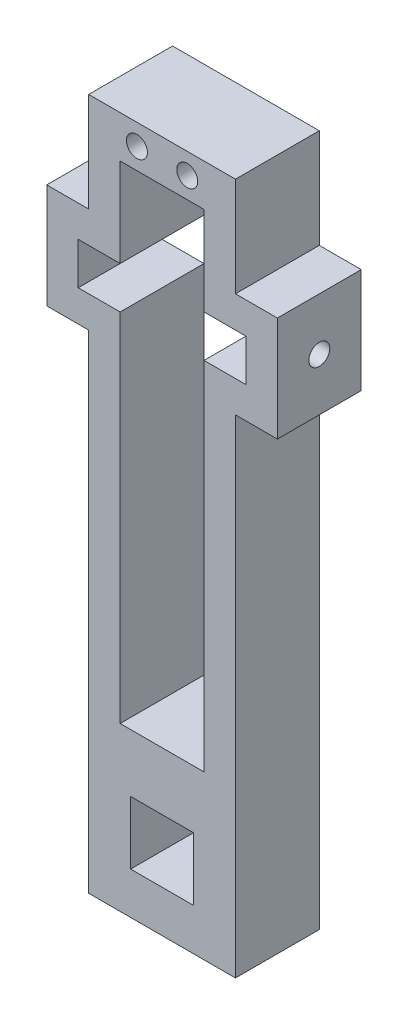
ISO-10303-21;
HEADER;
FILE_DESCRIPTION(('STEP AP214'),'2;1');
FILE_NAME('part.step','',(''),(''),'','','');
FILE_SCHEMA(('AUTOMOTIVE_DESIGN { 1 0 10303 214 1 1 1 1 }'));
ENDSEC;
DATA;
#1=APPLICATION_CONTEXT('core data for automotive mechanical design processes');
#2=APPLICATION_PROTOCOL_DEFINITION('international standard','automotive_design',2000,#1);
#3=PRODUCT_CONTEXT('',#1,'mechanical');
#4=PRODUCT('Part','Part','',(#3));
#5=PRODUCT_RELATED_PRODUCT_CATEGORY('part','',(#4));
#6=PRODUCT_DEFINITION_FORMATION('','',#4);
#7=PRODUCT_DEFINITION_CONTEXT('part definition',#1,'design');
#8=PRODUCT_DEFINITION('design','',#6,#7);
#9=PRODUCT_DEFINITION_SHAPE('','',#8);
#10=(LENGTH_UNIT() NAMED_UNIT(*) SI_UNIT(.MILLI.,.METRE.));
#11=(NAMED_UNIT(*) PLANE_ANGLE_UNIT() SI_UNIT($,.RADIAN.));
#12=(NAMED_UNIT(*) SI_UNIT($,.STERADIAN.) SOLID_ANGLE_UNIT());
#13=UNCERTAINTY_MEASURE_WITH_UNIT(LENGTH_MEASURE(1.E-05),#10,'distance_accuracy_value','');
#14=(GEOMETRIC_REPRESENTATION_CONTEXT(3) GLOBAL_UNCERTAINTY_ASSIGNED_CONTEXT((#13)) GLOBAL_UNIT_ASSIGNED_CONTEXT((#10,
#11,#12)) REPRESENTATION_CONTEXT('',''));
#15=CARTESIAN_POINT('',(0.,0.,0.));
#16=DIRECTION('',(0.,0.,1.));
#17=DIRECTION('',(1.,0.,0.));
#18=AXIS2_PLACEMENT_3D('',#15,#16,#17);
#19=CARTESIAN_POINT('',(0.,0.,4.));
#20=DIRECTION('',(0.,0.,1.));
#21=DIRECTION('',(1.,0.,0.));
#22=AXIS2_PLACEMENT_3D('',#19,#20,#21);
#23=PLANE('',#22);
#24=CARTESIAN_POINT('',(-1.2,28.5,4.));
#25=DIRECTION('',(0.,0.,1.));
#26=DIRECTION('',(1.,0.,0.));
#27=AXIS2_PLACEMENT_3D('',#24,#25,#26);
#28=CIRCLE('',#27,0.5);
#29=CARTESIAN_POINT('',(-0.7,28.5,4.));
#30=VERTEX_POINT('',#29);
#31=EDGE_CURVE('E266',#30,#30,#28,.T.);
#32=ORIENTED_EDGE('',*,*,#31,.F.);
#33=EDGE_LOOP('',(#32));
#34=FACE_BOUND('',#33,.T.);
#35=DIRECTION('',(0.,-1.,0.));
#36=VECTOR('',#35,1.);
#37=CARTESIAN_POINT('',(-3.5,3.5,4.));
#38=LINE('',#37,#36);
#39=CARTESIAN_POINT('',(-3.5,19.7632289487629,4.));
#40=VERTEX_POINT('',#39);
#41=CARTESIAN_POINT('',(-3.5,-3.5,4.));
#42=VERTEX_POINT('',#41);
#43=EDGE_CURVE('E359',#40,#42,#38,.T.);
#44=ORIENTED_EDGE('',*,*,#43,.T.);
#45=DIRECTION('',(1.,0.,0.));
#46=VECTOR('',#45,1.);
#47=CARTESIAN_POINT('',(3.5,-3.5,4.));
#48=LINE('',#47,#46);
#49=CARTESIAN_POINT('',(3.5,-3.5,4.));
#50=VERTEX_POINT('',#49);
#51=EDGE_CURVE('E361',#42,#50,#48,.T.);
#52=ORIENTED_EDGE('',*,*,#51,.T.);
#53=DIRECTION('',(0.,1.,0.));
#54=VECTOR('',#53,1.);
#55=CARTESIAN_POINT('',(3.5,-3.5,4.));
#56=LINE('',#55,#54);
#57=CARTESIAN_POINT('',(3.5,19.7632289487629,4.));
#58=VERTEX_POINT('',#57);
#59=EDGE_CURVE('E364',#50,#58,#56,.T.);
#60=ORIENTED_EDGE('',*,*,#59,.T.);
#61=DIRECTION('',(1.,0.,0.));
#62=VECTOR('',#61,1.);
#63=CARTESIAN_POINT('',(3.5,19.7632289487629,4.));
#64=LINE('',#63,#62);
#65=CARTESIAN_POINT('',(5.5,19.7632289487629,4.));
#66=VERTEX_POINT('',#65);
#67=EDGE_CURVE('E366',#58,#66,#64,.T.);
#68=ORIENTED_EDGE('',*,*,#67,.T.);
#69=DIRECTION('',(0.,1.,0.));
#70=VECTOR('',#69,1.);
#71=CARTESIAN_POINT('',(5.5,19.7632289487629,4.));
#72=LINE('',#71,#70);
#73=CARTESIAN_POINT('',(5.5,24.7632289487629,4.));
#74=VERTEX_POINT('',#73);
#75=EDGE_CURVE('E368',#66,#74,#72,.T.);
#76=ORIENTED_EDGE('',*,*,#75,.T.);
#77=DIRECTION('',(-1.,0.,0.));
#78=VECTOR('',#77,1.);
#79=CARTESIAN_POINT('',(3.5,24.7632289487629,4.));
#80=LINE('',#79,#78);
#81=CARTESIAN_POINT('',(3.5,24.7632289487629,4.));
#82=VERTEX_POINT('',#81);
#83=EDGE_CURVE('E370',#74,#82,#80,.T.);
#84=ORIENTED_EDGE('',*,*,#83,.T.);
#85=DIRECTION('',(0.,1.,0.));
#86=VECTOR('',#85,1.);
#87=CARTESIAN_POINT('',(3.5,24.7632289487629,4.));
#88=LINE('',#87,#86);
#89=CARTESIAN_POINT('',(3.49999999999999,29.5,4.));
#90=VERTEX_POINT('',#89);
#91=EDGE_CURVE('E372',#82,#90,#88,.T.);
#92=ORIENTED_EDGE('',*,*,#91,.T.);
#93=DIRECTION('',(-1.,0.,0.));
#94=VECTOR('',#93,1.);
#95=CARTESIAN_POINT('',(-3.49999999999999,29.5,4.));
#96=LINE('',#95,#94);
#97=CARTESIAN_POINT('',(-3.49999999999999,29.5,4.));
#98=VERTEX_POINT('',#97);
#99=EDGE_CURVE('E374',#90,#98,#96,.T.);
#100=ORIENTED_EDGE('',*,*,#99,.T.);
#101=DIRECTION('',(0.,-1.,0.));
#102=VECTOR('',#101,1.);
#103=CARTESIAN_POINT('',(-3.5,27.5,4.));
#104=LINE('',#103,#102);
#105=CARTESIAN_POINT('',(-3.5,24.7632289487629,4.));
#106=VERTEX_POINT('',#105);
#107=EDGE_CURVE('E376',#98,#106,#104,.T.);
#108=ORIENTED_EDGE('',*,*,#107,.T.);
#109=DIRECTION('',(-1.,0.,0.));
#110=VECTOR('',#109,1.);
#111=CARTESIAN_POINT('',(-3.5,24.7632289487629,4.));
#112=LINE('',#111,#110);
#113=CARTESIAN_POINT('',(-5.5,24.7632289487629,4.));
#114=VERTEX_POINT('',#113);
#115=EDGE_CURVE('E378',#106,#114,#112,.T.);
#116=ORIENTED_EDGE('',*,*,#115,.T.);
#117=DIRECTION('',(0.,-1.,0.));
#118=VECTOR('',#117,1.);
#119=CARTESIAN_POINT('',(-5.5,19.7632289487629,4.));
#120=LINE('',#119,#118);
#121=CARTESIAN_POINT('',(-5.5,19.7632289487629,4.));
#122=VERTEX_POINT('',#121);
#123=EDGE_CURVE('E380',#114,#122,#120,.T.);
#124=ORIENTED_EDGE('',*,*,#123,.T.);
#125=DIRECTION('',(1.,0.,0.));
#126=VECTOR('',#125,1.);
#127=CARTESIAN_POINT('',(-3.5,19.7632289487629,4.));
#128=LINE('',#127,#126);
#129=EDGE_CURVE('E382',#122,#40,#128,.T.);
#130=ORIENTED_EDGE('',*,*,#129,.T.);
#131=EDGE_LOOP('',(#44,#52,#60,#68,#76,#84,#92,#100,#108,#116,#124,#130));
#132=FACE_BOUND('',#131,.T.);
#133=DIRECTION('',(-1.,0.,0.));
#134=VECTOR('',#133,1.);
#135=CARTESIAN_POINT('',(-4.,23.2632289487629,4.));
#136=LINE('',#135,#134);
#137=CARTESIAN_POINT('',(-2.,23.2632289487629,4.));
#138=VERTEX_POINT('',#137);
#139=CARTESIAN_POINT('',(-4.,23.2632289487629,4.));
#140=VERTEX_POINT('',#139);
#141=EDGE_CURVE('E274',#138,#140,#136,.T.);
#142=ORIENTED_EDGE('',*,*,#141,.F.);
#143=DIRECTION('',(0.,-1.,0.));
#144=VECTOR('',#143,1.);
#145=CARTESIAN_POINT('',(-2.,27.5,4.));
#146=LINE('',#145,#144);
#147=CARTESIAN_POINT('',(-2.,27.5,4.));
#148=VERTEX_POINT('',#147);
#149=EDGE_CURVE('E272',#148,#138,#146,.T.);
#150=ORIENTED_EDGE('',*,*,#149,.F.);
#151=DIRECTION('',(-1.,0.,0.));
#152=VECTOR('',#151,1.);
#153=CARTESIAN_POINT('',(-2.,27.5,4.));
#154=LINE('',#153,#152);
#155=CARTESIAN_POINT('',(2.,27.5,4.));
#156=VERTEX_POINT('',#155);
#157=EDGE_CURVE('E296',#156,#148,#154,.T.);
#158=ORIENTED_EDGE('',*,*,#157,.F.);
#159=DIRECTION('',(0.,1.,0.));
#160=VECTOR('',#159,1.);
#161=CARTESIAN_POINT('',(2.,27.5,4.));
#162=LINE('',#161,#160);
#163=CARTESIAN_POINT('',(2.,23.2632289487629,4.));
#164=VERTEX_POINT('',#163);
#165=EDGE_CURVE('E293',#164,#156,#162,.T.);
#166=ORIENTED_EDGE('',*,*,#165,.F.);
#167=DIRECTION('',(-1.,0.,0.));
#168=VECTOR('',#167,1.);
#169=CARTESIAN_POINT('',(4.,23.2632289487629,4.));
#170=LINE('',#169,#168);
#171=CARTESIAN_POINT('',(4.,23.2632289487629,4.));
#172=VERTEX_POINT('',#171);
#173=EDGE_CURVE('E291',#172,#164,#170,.T.);
#174=ORIENTED_EDGE('',*,*,#173,.F.);
#175=DIRECTION('',(0.,1.,0.));
#176=VECTOR('',#175,1.);
#177=CARTESIAN_POINT('',(4.,21.2632289487629,4.));
#178=LINE('',#177,#176);
#179=CARTESIAN_POINT('',(4.,21.2632289487629,4.));
#180=VERTEX_POINT('',#179);
#181=EDGE_CURVE('E289',#180,#172,#178,.T.);
#182=ORIENTED_EDGE('',*,*,#181,.F.);
#183=DIRECTION('',(1.,0.,0.));
#184=VECTOR('',#183,1.);
#185=CARTESIAN_POINT('',(4.,21.2632289487629,4.));
#186=LINE('',#185,#184);
#187=CARTESIAN_POINT('',(2.,21.2632289487629,4.));
#188=VERTEX_POINT('',#187);
#189=EDGE_CURVE('E287',#188,#180,#186,.T.);
#190=ORIENTED_EDGE('',*,*,#189,.F.);
#191=DIRECTION('',(0.,1.,0.));
#192=VECTOR('',#191,1.);
#193=CARTESIAN_POINT('',(2.,21.2632289487629,4.));
#194=LINE('',#193,#192);
#195=CARTESIAN_POINT('',(2.,4.26322894876288,4.));
#196=VERTEX_POINT('',#195);
#197=EDGE_CURVE('E285',#196,#188,#194,.T.);
#198=ORIENTED_EDGE('',*,*,#197,.F.);
#199=DIRECTION('',(1.,0.,0.));
#200=VECTOR('',#199,1.);
#201=CARTESIAN_POINT('',(2.,4.26322894876288,4.));
#202=LINE('',#201,#200);
#203=CARTESIAN_POINT('',(-2.,4.26322894876288,4.));
#204=VERTEX_POINT('',#203);
#205=EDGE_CURVE('E283',#204,#196,#202,.T.);
#206=ORIENTED_EDGE('',*,*,#205,.F.);
#207=DIRECTION('',(0.,-1.,0.));
#208=VECTOR('',#207,1.);
#209=CARTESIAN_POINT('',(-2.,21.2632289487629,4.));
#210=LINE('',#209,#208);
#211=CARTESIAN_POINT('',(-2.,21.2632289487629,4.));
#212=VERTEX_POINT('',#211);
#213=EDGE_CURVE('E281',#212,#204,#210,.T.);
#214=ORIENTED_EDGE('',*,*,#213,.F.);
#215=DIRECTION('',(1.,0.,0.));
#216=VECTOR('',#215,1.);
#217=CARTESIAN_POINT('',(-4.,21.2632289487629,4.));
#218=LINE('',#217,#216);
#219=CARTESIAN_POINT('',(-4.,21.2632289487629,4.));
#220=VERTEX_POINT('',#219);
#221=EDGE_CURVE('E279',#220,#212,#218,.T.);
#222=ORIENTED_EDGE('',*,*,#221,.F.);
#223=DIRECTION('',(0.,-1.,0.));
#224=VECTOR('',#223,1.);
#225=CARTESIAN_POINT('',(-4.,21.2632289487629,4.));
#226=LINE('',#225,#224);
#227=EDGE_CURVE('E277',#140,#220,#226,.T.);
#228=ORIENTED_EDGE('',*,*,#227,.F.);
#229=EDGE_LOOP('',(#142,#150,#158,#166,#174,#182,#190,#198,#206,#214,#222,#228));
#230=FACE_BOUND('',#229,.T.);
#231=CARTESIAN_POINT('',(1.2,28.5,4.));
#232=DIRECTION('',(0.,0.,1.));
#233=DIRECTION('',(-1.,0.,0.));
#234=AXIS2_PLACEMENT_3D('',#231,#232,#233);
#235=CIRCLE('',#234,0.5);
#236=CARTESIAN_POINT('',(0.7,28.5,4.));
#237=VERTEX_POINT('',#236);
#238=EDGE_CURVE('E260',#237,#237,#235,.T.);
#239=ORIENTED_EDGE('',*,*,#238,.F.);
#240=EDGE_LOOP('',(#239));
#241=FACE_BOUND('',#240,.T.);
#242=DIRECTION('',(-1.,0.,0.));
#243=VECTOR('',#242,1.);
#244=CARTESIAN_POINT('',(-1.5,1.5,4.));
#245=LINE('',#244,#243);
#246=CARTESIAN_POINT('',(1.5,1.5,4.));
#247=VERTEX_POINT('',#246);
#248=CARTESIAN_POINT('',(-1.5,1.5,4.));
#249=VERTEX_POINT('',#248);
#250=EDGE_CURVE('E230',#247,#249,#245,.T.);
#251=ORIENTED_EDGE('',*,*,#250,.F.);
#252=DIRECTION('',(0.,1.,0.));
#253=VECTOR('',#252,1.);
#254=CARTESIAN_POINT('',(1.5,-1.5,4.));
#255=LINE('',#254,#253);
#256=CARTESIAN_POINT('',(1.5,-1.5,4.));
#257=VERTEX_POINT('',#256);
#258=EDGE_CURVE('E222',#257,#247,#255,.T.);
#259=ORIENTED_EDGE('',*,*,#258,.F.);
#260=DIRECTION('',(1.,0.,0.));
#261=VECTOR('',#260,1.);
#262=CARTESIAN_POINT('',(-1.5,-1.5,4.));
#263=LINE('',#262,#261);
#264=CARTESIAN_POINT('',(-1.5,-1.5,4.));
#265=VERTEX_POINT('',#264);
#266=EDGE_CURVE('E244',#265,#257,#263,.T.);
#267=ORIENTED_EDGE('',*,*,#266,.F.);
#268=DIRECTION('',(0.,-1.,0.));
#269=VECTOR('',#268,1.);
#270=CARTESIAN_POINT('',(-1.5,-1.5,4.));
#271=LINE('',#270,#269);
#272=EDGE_CURVE('E242',#249,#265,#271,.T.);
#273=ORIENTED_EDGE('',*,*,#272,.F.);
#274=EDGE_LOOP('',(#251,#259,#267,#273));
#275=FACE_BOUND('',#274,.T.);
#276=ADVANCED_FACE('F36',(#34,#132,#230,#241,#275),#23,.T.);
#277=CARTESIAN_POINT('',(0.,0.,0.));
#278=DIRECTION('',(0.,0.,1.));
#279=DIRECTION('',(1.,0.,0.));
#280=AXIS2_PLACEMENT_3D('',#277,#278,#279);
#281=PLANE('',#280);
#282=CARTESIAN_POINT('',(1.2,28.5,0.));
#283=DIRECTION('',(0.,0.,1.));
#284=DIRECTION('',(-1.,0.,0.));
#285=AXIS2_PLACEMENT_3D('',#282,#283,#284);
#286=CIRCLE('',#285,0.5);
#287=CARTESIAN_POINT('',(0.7,28.5,0.));
#288=VERTEX_POINT('',#287);
#289=EDGE_CURVE('E238',#288,#288,#286,.T.);
#290=ORIENTED_EDGE('',*,*,#289,.T.);
#291=EDGE_LOOP('',(#290));
#292=FACE_BOUND('',#291,.T.);
#293=CARTESIAN_POINT('',(-1.2,28.5,0.));
#294=DIRECTION('',(0.,0.,1.));
#295=DIRECTION('',(1.,0.,0.));
#296=AXIS2_PLACEMENT_3D('',#293,#294,#295);
#297=CIRCLE('',#296,0.5);
#298=CARTESIAN_POINT('',(-0.7,28.5,0.));
#299=VERTEX_POINT('',#298);
#300=EDGE_CURVE('E263',#299,#299,#297,.T.);
#301=ORIENTED_EDGE('',*,*,#300,.T.);
#302=EDGE_LOOP('',(#301));
#303=FACE_BOUND('',#302,.T.);
#304=DIRECTION('',(0.,-1.,0.));
#305=VECTOR('',#304,1.);
#306=CARTESIAN_POINT('',(-2.,27.5,0.));
#307=LINE('',#306,#305);
#308=CARTESIAN_POINT('',(-2.,27.5,0.));
#309=VERTEX_POINT('',#308);
#310=CARTESIAN_POINT('',(-2.,23.2632289487629,0.));
#311=VERTEX_POINT('',#310);
#312=EDGE_CURVE('E269',#309,#311,#307,.T.);
#313=ORIENTED_EDGE('',*,*,#312,.T.);
#314=DIRECTION('',(-1.,0.,0.));
#315=VECTOR('',#314,1.);
#316=CARTESIAN_POINT('',(-4.,23.2632289487629,0.));
#317=LINE('',#316,#315);
#318=CARTESIAN_POINT('',(-4.,23.2632289487629,0.));
#319=VERTEX_POINT('',#318);
#320=EDGE_CURVE('E301',#311,#319,#317,.T.);
#321=ORIENTED_EDGE('',*,*,#320,.T.);
#322=DIRECTION('',(0.,-1.,0.));
#323=VECTOR('',#322,1.);
#324=CARTESIAN_POINT('',(-4.,21.2632289487629,0.));
#325=LINE('',#324,#323);
#326=CARTESIAN_POINT('',(-4.,21.2632289487629,0.));
#327=VERTEX_POINT('',#326);
#328=EDGE_CURVE('E304',#319,#327,#325,.T.);
#329=ORIENTED_EDGE('',*,*,#328,.T.);
#330=DIRECTION('',(1.,0.,0.));
#331=VECTOR('',#330,1.);
#332=CARTESIAN_POINT('',(-4.,21.2632289487629,0.));
#333=LINE('',#332,#331);
#334=CARTESIAN_POINT('',(-2.,21.2632289487629,0.));
#335=VERTEX_POINT('',#334);
#336=EDGE_CURVE('E307',#327,#335,#333,.T.);
#337=ORIENTED_EDGE('',*,*,#336,.T.);
#338=DIRECTION('',(0.,-1.,0.));
#339=VECTOR('',#338,1.);
#340=CARTESIAN_POINT('',(-2.,21.2632289487629,0.));
#341=LINE('',#340,#339);
#342=CARTESIAN_POINT('',(-2.,4.26322894876288,0.));
#343=VERTEX_POINT('',#342);
#344=EDGE_CURVE('E310',#335,#343,#341,.T.);
#345=ORIENTED_EDGE('',*,*,#344,.T.);
#346=DIRECTION('',(1.,0.,0.));
#347=VECTOR('',#346,1.);
#348=CARTESIAN_POINT('',(2.,4.26322894876288,0.));
#349=LINE('',#348,#347);
#350=CARTESIAN_POINT('',(2.,4.26322894876288,0.));
#351=VERTEX_POINT('',#350);
#352=EDGE_CURVE('E313',#343,#351,#349,.T.);
#353=ORIENTED_EDGE('',*,*,#352,.T.);
#354=DIRECTION('',(0.,1.,0.));
#355=VECTOR('',#354,1.);
#356=CARTESIAN_POINT('',(2.,21.2632289487629,0.));
#357=LINE('',#356,#355);
#358=CARTESIAN_POINT('',(2.,21.2632289487629,0.));
#359=VERTEX_POINT('',#358);
#360=EDGE_CURVE('E316',#351,#359,#357,.T.);
#361=ORIENTED_EDGE('',*,*,#360,.T.);
#362=DIRECTION('',(1.,0.,0.));
#363=VECTOR('',#362,1.);
#364=CARTESIAN_POINT('',(4.,21.2632289487629,0.));
#365=LINE('',#364,#363);
#366=CARTESIAN_POINT('',(4.,21.2632289487629,0.));
#367=VERTEX_POINT('',#366);
#368=EDGE_CURVE('E319',#359,#367,#365,.T.);
#369=ORIENTED_EDGE('',*,*,#368,.T.);
#370=DIRECTION('',(0.,1.,0.));
#371=VECTOR('',#370,1.);
#372=CARTESIAN_POINT('',(4.,21.2632289487629,0.));
#373=LINE('',#372,#371);
#374=CARTESIAN_POINT('',(4.,23.2632289487629,0.));
#375=VERTEX_POINT('',#374);
#376=EDGE_CURVE('E322',#367,#375,#373,.T.);
#377=ORIENTED_EDGE('',*,*,#376,.T.);
#378=DIRECTION('',(-1.,0.,0.));
#379=VECTOR('',#378,1.);
#380=CARTESIAN_POINT('',(4.,23.2632289487629,0.));
#381=LINE('',#380,#379);
#382=CARTESIAN_POINT('',(2.,23.2632289487629,0.));
#383=VERTEX_POINT('',#382);
#384=EDGE_CURVE('E325',#375,#383,#381,.T.);
#385=ORIENTED_EDGE('',*,*,#384,.T.);
#386=DIRECTION('',(0.,1.,0.));
#387=VECTOR('',#386,1.);
#388=CARTESIAN_POINT('',(2.,27.5,0.));
#389=LINE('',#388,#387);
#390=CARTESIAN_POINT('',(2.,27.5,0.));
#391=VERTEX_POINT('',#390);
#392=EDGE_CURVE('E328',#383,#391,#389,.T.);
#393=ORIENTED_EDGE('',*,*,#392,.T.);
#394=DIRECTION('',(-1.,0.,0.));
#395=VECTOR('',#394,1.);
#396=CARTESIAN_POINT('',(-2.,27.5,0.));
#397=LINE('',#396,#395);
#398=EDGE_CURVE('E275',#391,#309,#397,.T.);
#399=ORIENTED_EDGE('',*,*,#398,.T.);
#400=EDGE_LOOP('',(#313,#321,#329,#337,#345,#353,#361,#369,#377,#385,#393,#399));
#401=FACE_BOUND('',#400,.T.);
#402=DIRECTION('',(0.,-1.,0.));
#403=VECTOR('',#402,1.);
#404=CARTESIAN_POINT('',(-3.5,-3.5,0.));
#405=LINE('',#404,#403);
#406=CARTESIAN_POINT('',(-3.5,19.7632289487629,0.));
#407=VERTEX_POINT('',#406);
#408=CARTESIAN_POINT('',(-3.5,-3.5,0.));
#409=VERTEX_POINT('',#408);
#410=EDGE_CURVE('E358',#407,#409,#405,.T.);
#411=ORIENTED_EDGE('',*,*,#410,.F.);
#412=DIRECTION('',(1.,0.,0.));
#413=VECTOR('',#412,1.);
#414=CARTESIAN_POINT('',(-3.5,19.7632289487629,0.));
#415=LINE('',#414,#413);
#416=CARTESIAN_POINT('',(-5.5,19.7632289487629,0.));
#417=VERTEX_POINT('',#416);
#418=EDGE_CURVE('E362',#417,#407,#415,.T.);
#419=ORIENTED_EDGE('',*,*,#418,.F.);
#420=DIRECTION('',(0.,-1.,0.));
#421=VECTOR('',#420,1.);
#422=CARTESIAN_POINT('',(-5.5,19.7632289487629,0.));
#423=LINE('',#422,#421);
#424=CARTESIAN_POINT('',(-5.5,24.7632289487629,0.));
#425=VERTEX_POINT('',#424);
#426=EDGE_CURVE('E407',#425,#417,#423,.T.);
#427=ORIENTED_EDGE('',*,*,#426,.F.);
#428=DIRECTION('',(-1.,0.,0.));
#429=VECTOR('',#428,1.);
#430=CARTESIAN_POINT('',(-3.5,24.7632289487629,0.));
#431=LINE('',#430,#429);
#432=CARTESIAN_POINT('',(-3.5,24.7632289487629,0.));
#433=VERTEX_POINT('',#432);
#434=EDGE_CURVE('E405',#433,#425,#431,.T.);
#435=ORIENTED_EDGE('',*,*,#434,.F.);
#436=DIRECTION('',(0.,-1.,0.));
#437=VECTOR('',#436,1.);
#438=CARTESIAN_POINT('',(-3.5,24.7632289487629,0.));
#439=LINE('',#438,#437);
#440=CARTESIAN_POINT('',(-3.49999999999999,29.5,0.));
#441=VERTEX_POINT('',#440);
#442=EDGE_CURVE('E403',#441,#433,#439,.T.);
#443=ORIENTED_EDGE('',*,*,#442,.F.);
#444=DIRECTION('',(-1.,0.,0.));
#445=VECTOR('',#444,1.);
#446=CARTESIAN_POINT('',(-3.49999999999999,29.5,0.));
#447=LINE('',#446,#445);
#448=CARTESIAN_POINT('',(3.49999999999999,29.5,0.));
#449=VERTEX_POINT('',#448);
#450=EDGE_CURVE('E400',#449,#441,#447,.T.);
#451=ORIENTED_EDGE('',*,*,#450,.F.);
#452=DIRECTION('',(0.,1.,0.));
#453=VECTOR('',#452,1.);
#454=CARTESIAN_POINT('',(3.5,27.5,0.));
#455=LINE('',#454,#453);
#456=CARTESIAN_POINT('',(3.5,24.7632289487629,0.));
#457=VERTEX_POINT('',#456);
#458=EDGE_CURVE('E398',#457,#449,#455,.T.);
#459=ORIENTED_EDGE('',*,*,#458,.F.);
#460=DIRECTION('',(-1.,0.,0.));
#461=VECTOR('',#460,1.);
#462=CARTESIAN_POINT('',(3.5,24.7632289487629,0.));
#463=LINE('',#462,#461);
#464=CARTESIAN_POINT('',(5.5,24.7632289487629,0.));
#465=VERTEX_POINT('',#464);
#466=EDGE_CURVE('E395',#465,#457,#463,.T.);
#467=ORIENTED_EDGE('',*,*,#466,.F.);
#468=DIRECTION('',(0.,1.,0.));
#469=VECTOR('',#468,1.);
#470=CARTESIAN_POINT('',(5.5,19.7632289487629,0.));
#471=LINE('',#470,#469);
#472=CARTESIAN_POINT('',(5.5,19.7632289487629,0.));
#473=VERTEX_POINT('',#472);
#474=EDGE_CURVE('E393',#473,#465,#471,.T.);
#475=ORIENTED_EDGE('',*,*,#474,.F.);
#476=DIRECTION('',(1.,0.,0.));
#477=VECTOR('',#476,1.);
#478=CARTESIAN_POINT('',(3.5,19.7632289487629,0.));
#479=LINE('',#478,#477);
#480=CARTESIAN_POINT('',(3.5,19.7632289487629,0.));
#481=VERTEX_POINT('',#480);
#482=EDGE_CURVE('E391',#481,#473,#479,.T.);
#483=ORIENTED_EDGE('',*,*,#482,.F.);
#484=DIRECTION('',(0.,1.,0.));
#485=VECTOR('',#484,1.);
#486=CARTESIAN_POINT('',(3.5,3.5,0.));
#487=LINE('',#486,#485);
#488=CARTESIAN_POINT('',(3.5,-3.5,0.));
#489=VERTEX_POINT('',#488);
#490=EDGE_CURVE('E389',#489,#481,#487,.T.);
#491=ORIENTED_EDGE('',*,*,#490,.F.);
#492=DIRECTION('',(1.,0.,0.));
#493=VECTOR('',#492,1.);
#494=CARTESIAN_POINT('',(3.5,-3.5,0.));
#495=LINE('',#494,#493);
#496=EDGE_CURVE('E386',#409,#489,#495,.T.);
#497=ORIENTED_EDGE('',*,*,#496,.F.);
#498=EDGE_LOOP('',(#411,#419,#427,#435,#443,#451,#459,#467,#475,#483,#491,#497));
#499=FACE_BOUND('',#498,.T.);
#500=DIRECTION('',(0.,1.,0.));
#501=VECTOR('',#500,1.);
#502=CARTESIAN_POINT('',(1.5,-1.5,0.));
#503=LINE('',#502,#501);
#504=CARTESIAN_POINT('',(1.5,-1.5,0.));
#505=VERTEX_POINT('',#504);
#506=CARTESIAN_POINT('',(1.5,1.5,0.));
#507=VERTEX_POINT('',#506);
#508=EDGE_CURVE('E60',#505,#507,#503,.T.);
#509=ORIENTED_EDGE('',*,*,#508,.T.);
#510=DIRECTION('',(-1.,0.,0.));
#511=VECTOR('',#510,1.);
#512=CARTESIAN_POINT('',(-1.5,1.5,0.));
#513=LINE('',#512,#511);
#514=CARTESIAN_POINT('',(-1.5,1.5,0.));
#515=VERTEX_POINT('',#514);
#516=EDGE_CURVE('E237',#507,#515,#513,.T.);
#517=ORIENTED_EDGE('',*,*,#516,.T.);
#518=DIRECTION('',(0.,-1.,0.));
#519=VECTOR('',#518,1.);
#520=CARTESIAN_POINT('',(-1.5,-1.5,0.));
#521=LINE('',#520,#519);
#522=CARTESIAN_POINT('',(-1.5,-1.5,0.));
#523=VERTEX_POINT('',#522);
#524=EDGE_CURVE('E252',#515,#523,#521,.T.);
#525=ORIENTED_EDGE('',*,*,#524,.T.);
#526=DIRECTION('',(1.,0.,0.));
#527=VECTOR('',#526,1.);
#528=CARTESIAN_POINT('',(-1.5,-1.5,0.));
#529=LINE('',#528,#527);
#530=EDGE_CURVE('E231',#523,#505,#529,.T.);
#531=ORIENTED_EDGE('',*,*,#530,.T.);
#532=EDGE_LOOP('',(#509,#517,#525,#531));
#533=FACE_BOUND('',#532,.T.);
#534=ADVANCED_FACE('F452',(#292,#303,#401,#499,#533),#281,.F.);
#535=CARTESIAN_POINT('',(-3.5,-3.5,4.));
#536=DIRECTION('',(1.,0.,0.));
#537=DIRECTION('',(0.,0.,-1.));
#538=AXIS2_PLACEMENT_3D('',#535,#536,#537);
#539=PLANE('',#538);
#540=ORIENTED_EDGE('',*,*,#410,.T.);
#541=DIRECTION('',(0.,0.,-1.));
#542=VECTOR('',#541,1.);
#543=CARTESIAN_POINT('',(-3.5,-3.5,4.));
#544=LINE('',#543,#542);
#545=EDGE_CURVE('E11',#42,#409,#544,.T.);
#546=ORIENTED_EDGE('',*,*,#545,.F.);
#547=ORIENTED_EDGE('',*,*,#43,.F.);
#548=DIRECTION('',(0.,0.,-1.));
#549=VECTOR('',#548,1.);
#550=CARTESIAN_POINT('',(-3.5,19.7632289487629,4.));
#551=LINE('',#550,#549);
#552=EDGE_CURVE('E384',#40,#407,#551,.T.);
#553=ORIENTED_EDGE('',*,*,#552,.T.);
#554=EDGE_LOOP('',(#540,#546,#547,#553));
#555=FACE_BOUND('',#554,.T.);
#556=ADVANCED_FACE('F38',(#555),#539,.F.);
#557=CARTESIAN_POINT('',(3.5,-3.5,4.));
#558=DIRECTION('',(0.,1.,0.));
#559=DIRECTION('',(-1.,0.,0.));
#560=AXIS2_PLACEMENT_3D('',#557,#558,#559);
#561=PLANE('',#560);
#562=ORIENTED_EDGE('',*,*,#496,.T.);
#563=DIRECTION('',(0.,0.,-1.));
#564=VECTOR('',#563,1.);
#565=CARTESIAN_POINT('',(3.5,-3.5,4.));
#566=LINE('',#565,#564);
#567=EDGE_CURVE('E45',#50,#489,#566,.T.);
#568=ORIENTED_EDGE('',*,*,#567,.F.);
#569=ORIENTED_EDGE('',*,*,#51,.F.);
#570=ORIENTED_EDGE('',*,*,#545,.T.);
#571=EDGE_LOOP('',(#562,#568,#569,#570));
#572=FACE_BOUND('',#571,.T.);
#573=ADVANCED_FACE('F448',(#572),#561,.F.);
#574=CARTESIAN_POINT('',(3.5,3.5,4.));
#575=DIRECTION('',(-1.,0.,0.));
#576=DIRECTION('',(0.,-1.,0.));
#577=AXIS2_PLACEMENT_3D('',#574,#575,#576);
#578=PLANE('',#577);
#579=ORIENTED_EDGE('',*,*,#490,.T.);
#580=DIRECTION('',(0.,0.,-1.));
#581=VECTOR('',#580,1.);
#582=CARTESIAN_POINT('',(3.5,19.7632289487629,4.));
#583=LINE('',#582,#581);
#584=EDGE_CURVE('E437',#58,#481,#583,.T.);
#585=ORIENTED_EDGE('',*,*,#584,.F.);
#586=ORIENTED_EDGE('',*,*,#59,.F.);
#587=ORIENTED_EDGE('',*,*,#567,.T.);
#588=EDGE_LOOP('',(#579,#585,#586,#587));
#589=FACE_BOUND('',#588,.T.);
#590=ADVANCED_FACE('F444',(#589),#578,.F.);
#591=CARTESIAN_POINT('',(3.5,19.7632289487629,4.));
#592=DIRECTION('',(0.,1.,0.));
#593=DIRECTION('',(-1.,0.,0.));
#594=AXIS2_PLACEMENT_3D('',#591,#592,#593);
#595=PLANE('',#594);
#596=ORIENTED_EDGE('',*,*,#482,.T.);
#597=DIRECTION('',(0.,0.,-1.));
#598=VECTOR('',#597,1.);
#599=CARTESIAN_POINT('',(5.5,19.7632289487629,4.));
#600=LINE('',#599,#598);
#601=EDGE_CURVE('E434',#66,#473,#600,.T.);
#602=ORIENTED_EDGE('',*,*,#601,.F.);
#603=ORIENTED_EDGE('',*,*,#67,.F.);
#604=ORIENTED_EDGE('',*,*,#584,.T.);
#605=EDGE_LOOP('',(#596,#602,#603,#604));
#606=FACE_BOUND('',#605,.T.);
#607=ADVANCED_FACE('F460',(#606),#595,.F.);
#608=CARTESIAN_POINT('',(5.5,19.7632289487629,4.));
#609=DIRECTION('',(-1.,0.,0.));
#610=DIRECTION('',(0.,0.,1.));
#611=AXIS2_PLACEMENT_3D('',#608,#609,#610);
#612=PLANE('',#611);
#613=CARTESIAN_POINT('',(5.5,22.2632289487629,2.));
#614=DIRECTION('',(-1.,0.,0.));
#615=DIRECTION('',(0.,0.,1.));
#616=AXIS2_PLACEMENT_3D('',#613,#614,#615);
#617=CIRCLE('',#616,0.5);
#618=CARTESIAN_POINT('',(5.5,22.2632289487629,2.5));
#619=VERTEX_POINT('',#618);
#620=EDGE_CURVE('E896',#619,#619,#617,.T.);
#621=ORIENTED_EDGE('',*,*,#620,.T.);
#622=EDGE_LOOP('',(#621));
#623=FACE_BOUND('',#622,.T.);
#624=ORIENTED_EDGE('',*,*,#474,.T.);
#625=DIRECTION('',(0.,0.,-1.));
#626=VECTOR('',#625,1.);
#627=CARTESIAN_POINT('',(5.5,24.7632289487629,4.));
#628=LINE('',#627,#626);
#629=EDGE_CURVE('E431',#74,#465,#628,.T.);
#630=ORIENTED_EDGE('',*,*,#629,.F.);
#631=ORIENTED_EDGE('',*,*,#75,.F.);
#632=ORIENTED_EDGE('',*,*,#601,.T.);
#633=EDGE_LOOP('',(#624,#630,#631,#632));
#634=FACE_BOUND('',#633,.T.);
#635=ADVANCED_FACE('F464',(#623,#634),#612,.F.);
#636=CARTESIAN_POINT('',(3.5,24.7632289487629,4.));
#637=DIRECTION('',(0.,-1.,0.));
#638=DIRECTION('',(1.,0.,0.));
#639=AXIS2_PLACEMENT_3D('',#636,#637,#638);
#640=PLANE('',#639);
#641=ORIENTED_EDGE('',*,*,#466,.T.);
#642=DIRECTION('',(0.,0.,-1.));
#643=VECTOR('',#642,1.);
#644=CARTESIAN_POINT('',(3.5,24.7632289487629,4.));
#645=LINE('',#644,#643);
#646=EDGE_CURVE('E428',#82,#457,#645,.T.);
#647=ORIENTED_EDGE('',*,*,#646,.F.);
#648=ORIENTED_EDGE('',*,*,#83,.F.);
#649=ORIENTED_EDGE('',*,*,#629,.T.);
#650=EDGE_LOOP('',(#641,#647,#648,#649));
#651=FACE_BOUND('',#650,.T.);
#652=ADVANCED_FACE('F500',(#651),#640,.F.);
#653=CARTESIAN_POINT('',(3.5,27.5,4.));
#654=DIRECTION('',(-1.,0.,0.));
#655=DIRECTION('',(0.,-1.,0.));
#656=AXIS2_PLACEMENT_3D('',#653,#654,#655);
#657=PLANE('',#656);
#658=ORIENTED_EDGE('',*,*,#458,.T.);
#659=DIRECTION('',(0.,0.,-1.));
#660=VECTOR('',#659,1.);
#661=CARTESIAN_POINT('',(3.49999999999999,29.5,4.));
#662=LINE('',#661,#660);
#663=EDGE_CURVE('E425',#90,#449,#662,.T.);
#664=ORIENTED_EDGE('',*,*,#663,.F.);
#665=ORIENTED_EDGE('',*,*,#91,.F.);
#666=ORIENTED_EDGE('',*,*,#646,.T.);
#667=EDGE_LOOP('',(#658,#664,#665,#666));
#668=FACE_BOUND('',#667,.T.);
#669=ADVANCED_FACE('F498',(#668),#657,.F.);
#670=CARTESIAN_POINT('',(-3.49999999999999,29.5,4.));
#671=DIRECTION('',(0.,-1.,0.));
#672=DIRECTION('',(0.,0.,-1.));
#673=AXIS2_PLACEMENT_3D('',#670,#671,#672);
#674=PLANE('',#673);
#675=ORIENTED_EDGE('',*,*,#450,.T.);
#676=DIRECTION('',(0.,0.,-1.));
#677=VECTOR('',#676,1.);
#678=CARTESIAN_POINT('',(-3.49999999999999,29.5,4.));
#679=LINE('',#678,#677);
#680=EDGE_CURVE('E422',#98,#441,#679,.T.);
#681=ORIENTED_EDGE('',*,*,#680,.F.);
#682=ORIENTED_EDGE('',*,*,#99,.F.);
#683=ORIENTED_EDGE('',*,*,#663,.T.);
#684=EDGE_LOOP('',(#675,#681,#682,#683));
#685=FACE_BOUND('',#684,.T.);
#686=ADVANCED_FACE('F493',(#685),#674,.F.);
#687=CARTESIAN_POINT('',(-3.5,24.7632289487629,4.));
#688=DIRECTION('',(1.,0.,0.));
#689=DIRECTION('',(0.,1.,0.));
#690=AXIS2_PLACEMENT_3D('',#687,#688,#689);
#691=PLANE('',#690);
#692=ORIENTED_EDGE('',*,*,#442,.T.);
#693=DIRECTION('',(0.,0.,-1.));
#694=VECTOR('',#693,1.);
#695=CARTESIAN_POINT('',(-3.5,24.7632289487629,4.));
#696=LINE('',#695,#694);
#697=EDGE_CURVE('E419',#106,#433,#696,.T.);
#698=ORIENTED_EDGE('',*,*,#697,.F.);
#699=ORIENTED_EDGE('',*,*,#107,.F.);
#700=ORIENTED_EDGE('',*,*,#680,.T.);
#701=EDGE_LOOP('',(#692,#698,#699,#700));
#702=FACE_BOUND('',#701,.T.);
#703=ADVANCED_FACE('F489',(#702),#691,.F.);
#704=CARTESIAN_POINT('',(-3.5,24.7632289487629,4.));
#705=DIRECTION('',(0.,-1.,0.));
#706=DIRECTION('',(1.,0.,0.));
#707=AXIS2_PLACEMENT_3D('',#704,#705,#706);
#708=PLANE('',#707);
#709=ORIENTED_EDGE('',*,*,#434,.T.);
#710=DIRECTION('',(0.,0.,-1.));
#711=VECTOR('',#710,1.);
#712=CARTESIAN_POINT('',(-5.5,24.7632289487629,4.));
#713=LINE('',#712,#711);
#714=EDGE_CURVE('E416',#114,#425,#713,.T.);
#715=ORIENTED_EDGE('',*,*,#714,.F.);
#716=ORIENTED_EDGE('',*,*,#115,.F.);
#717=ORIENTED_EDGE('',*,*,#697,.T.);
#718=EDGE_LOOP('',(#709,#715,#716,#717));
#719=FACE_BOUND('',#718,.T.);
#720=ADVANCED_FACE('F485',(#719),#708,.F.);
#721=CARTESIAN_POINT('',(-5.5,19.7632289487629,4.));
#722=DIRECTION('',(1.,0.,0.));
#723=DIRECTION('',(0.,0.,-1.));
#724=AXIS2_PLACEMENT_3D('',#721,#722,#723);
#725=PLANE('',#724);
#726=CARTESIAN_POINT('',(-5.5,22.2632289487629,2.));
#727=DIRECTION('',(-1.,0.,0.));
#728=DIRECTION('',(0.,0.,1.));
#729=AXIS2_PLACEMENT_3D('',#726,#727,#728);
#730=CIRCLE('',#729,0.5);
#731=CARTESIAN_POINT('',(-5.5,22.2632289487629,2.5));
#732=VERTEX_POINT('',#731);
#733=EDGE_CURVE('E895',#732,#732,#730,.T.);
#734=ORIENTED_EDGE('',*,*,#733,.F.);
#735=EDGE_LOOP('',(#734));
#736=FACE_BOUND('',#735,.T.);
#737=ORIENTED_EDGE('',*,*,#426,.T.);
#738=DIRECTION('',(0.,0.,-1.));
#739=VECTOR('',#738,1.);
#740=CARTESIAN_POINT('',(-5.5,19.7632289487629,4.));
#741=LINE('',#740,#739);
#742=EDGE_CURVE('E413',#122,#417,#741,.T.);
#743=ORIENTED_EDGE('',*,*,#742,.F.);
#744=ORIENTED_EDGE('',*,*,#123,.F.);
#745=ORIENTED_EDGE('',*,*,#714,.T.);
#746=EDGE_LOOP('',(#737,#743,#744,#745));
#747=FACE_BOUND('',#746,.T.);
#748=ADVANCED_FACE('F480',(#736,#747),#725,.F.);
#749=CARTESIAN_POINT('',(-3.5,19.7632289487629,4.));
#750=DIRECTION('',(0.,1.,0.));
#751=DIRECTION('',(-1.,0.,0.));
#752=AXIS2_PLACEMENT_3D('',#749,#750,#751);
#753=PLANE('',#752);
#754=ORIENTED_EDGE('',*,*,#418,.T.);
#755=ORIENTED_EDGE('',*,*,#552,.F.);
#756=ORIENTED_EDGE('',*,*,#129,.F.);
#757=ORIENTED_EDGE('',*,*,#742,.T.);
#758=EDGE_LOOP('',(#754,#755,#756,#757));
#759=FACE_BOUND('',#758,.T.);
#760=ADVANCED_FACE('F475',(#759),#753,.F.);
#761=CARTESIAN_POINT('',(-2.,27.5,4.));
#762=DIRECTION('',(1.,0.,0.));
#763=DIRECTION('',(0.,1.,0.));
#764=AXIS2_PLACEMENT_3D('',#761,#762,#763);
#765=PLANE('',#764);
#766=ORIENTED_EDGE('',*,*,#312,.F.);
#767=DIRECTION('',(0.,0.,-1.));
#768=VECTOR('',#767,1.);
#769=CARTESIAN_POINT('',(-2.,27.5,4.));
#770=LINE('',#769,#768);
#771=EDGE_CURVE('E298',#148,#309,#770,.T.);
#772=ORIENTED_EDGE('',*,*,#771,.F.);
#773=ORIENTED_EDGE('',*,*,#149,.T.);
#774=DIRECTION('',(0.,0.,-1.));
#775=VECTOR('',#774,1.);
#776=CARTESIAN_POINT('',(-2.,23.2632289487629,4.));
#777=LINE('',#776,#775);
#778=EDGE_CURVE('E355',#138,#311,#777,.T.);
#779=ORIENTED_EDGE('',*,*,#778,.T.);
#780=EDGE_LOOP('',(#766,#772,#773,#779));
#781=FACE_BOUND('',#780,.T.);
#782=ADVANCED_FACE('F520',(#781),#765,.T.);
#783=CARTESIAN_POINT('',(-4.,23.2632289487629,4.));
#784=DIRECTION('',(0.,-1.,0.));
#785=DIRECTION('',(0.,0.,-1.));
#786=AXIS2_PLACEMENT_3D('',#783,#784,#785);
#787=PLANE('',#786);
#788=ORIENTED_EDGE('',*,*,#320,.F.);
#789=ORIENTED_EDGE('',*,*,#778,.F.);
#790=ORIENTED_EDGE('',*,*,#141,.T.);
#791=DIRECTION('',(0.,0.,-1.));
#792=VECTOR('',#791,1.);
#793=CARTESIAN_POINT('',(-4.,23.2632289487629,4.));
#794=LINE('',#793,#792);
#795=EDGE_CURVE('E353',#140,#319,#794,.T.);
#796=ORIENTED_EDGE('',*,*,#795,.T.);
#797=EDGE_LOOP('',(#788,#789,#790,#796));
#798=FACE_BOUND('',#797,.T.);
#799=ADVANCED_FACE('F561',(#798),#787,.T.);
#800=CARTESIAN_POINT('',(-4.,21.2632289487629,4.));
#801=DIRECTION('',(1.,0.,0.));
#802=DIRECTION('',(0.,0.,-1.));
#803=AXIS2_PLACEMENT_3D('',#800,#801,#802);
#804=PLANE('',#803);
#805=CARTESIAN_POINT('',(-4.,22.2632289487629,2.));
#806=DIRECTION('',(1.,0.,0.));
#807=DIRECTION('',(0.,0.,-1.));
#808=AXIS2_PLACEMENT_3D('',#805,#806,#807);
#809=CIRCLE('',#808,0.5);
#810=CARTESIAN_POINT('',(-4.,22.2632289487629,1.5));
#811=VERTEX_POINT('',#810);
#812=EDGE_CURVE('E250',#811,#811,#809,.T.);
#813=ORIENTED_EDGE('',*,*,#812,.F.);
#814=EDGE_LOOP('',(#813));
#815=FACE_BOUND('',#814,.T.);
#816=ORIENTED_EDGE('',*,*,#328,.F.);
#817=ORIENTED_EDGE('',*,*,#795,.F.);
#818=ORIENTED_EDGE('',*,*,#227,.T.);
#819=DIRECTION('',(0.,0.,-1.));
#820=VECTOR('',#819,1.);
#821=CARTESIAN_POINT('',(-4.,21.2632289487629,4.));
#822=LINE('',#821,#820);
#823=EDGE_CURVE('E351',#220,#327,#822,.T.);
#824=ORIENTED_EDGE('',*,*,#823,.T.);
#825=EDGE_LOOP('',(#816,#817,#818,#824));
#826=FACE_BOUND('',#825,.T.);
#827=ADVANCED_FACE('F568',(#815,#826),#804,.T.);
#828=CARTESIAN_POINT('',(-4.,21.2632289487629,4.));
#829=DIRECTION('',(0.,1.,0.));
#830=DIRECTION('',(0.,0.,1.));
#831=AXIS2_PLACEMENT_3D('',#828,#829,#830);
#832=PLANE('',#831);
#833=ORIENTED_EDGE('',*,*,#336,.F.);
#834=ORIENTED_EDGE('',*,*,#823,.F.);
#835=ORIENTED_EDGE('',*,*,#221,.T.);
#836=DIRECTION('',(0.,0.,-1.));
#837=VECTOR('',#836,1.);
#838=CARTESIAN_POINT('',(-2.,21.2632289487629,4.));
#839=LINE('',#838,#837);
#840=EDGE_CURVE('E349',#212,#335,#839,.T.);
#841=ORIENTED_EDGE('',*,*,#840,.T.);
#842=EDGE_LOOP('',(#833,#834,#835,#841));
#843=FACE_BOUND('',#842,.T.);
#844=ADVANCED_FACE('F575',(#843),#832,.T.);
#845=CARTESIAN_POINT('',(-2.,21.2632289487629,4.));
#846=DIRECTION('',(1.,0.,0.));
#847=DIRECTION('',(0.,1.,0.));
#848=AXIS2_PLACEMENT_3D('',#845,#846,#847);
#849=PLANE('',#848);
#850=ORIENTED_EDGE('',*,*,#344,.F.);
#851=ORIENTED_EDGE('',*,*,#840,.F.);
#852=ORIENTED_EDGE('',*,*,#213,.T.);
#853=DIRECTION('',(0.,0.,-1.));
#854=VECTOR('',#853,1.);
#855=CARTESIAN_POINT('',(-2.,4.26322894876288,4.));
#856=LINE('',#855,#854);
#857=EDGE_CURVE('E347',#204,#343,#856,.T.);
#858=ORIENTED_EDGE('',*,*,#857,.T.);
#859=EDGE_LOOP('',(#850,#851,#852,#858));
#860=FACE_BOUND('',#859,.T.);
#861=ADVANCED_FACE('F583',(#860),#849,.T.);
#862=CARTESIAN_POINT('',(2.,4.26322894876288,4.));
#863=DIRECTION('',(0.,1.,0.));
#864=DIRECTION('',(-1.,0.,0.));
#865=AXIS2_PLACEMENT_3D('',#862,#863,#864);
#866=PLANE('',#865);
#867=ORIENTED_EDGE('',*,*,#352,.F.);
#868=ORIENTED_EDGE('',*,*,#857,.F.);
#869=ORIENTED_EDGE('',*,*,#205,.T.);
#870=DIRECTION('',(0.,0.,-1.));
#871=VECTOR('',#870,1.);
#872=CARTESIAN_POINT('',(2.,4.26322894876288,4.));
#873=LINE('',#872,#871);
#874=EDGE_CURVE('E345',#196,#351,#873,.T.);
#875=ORIENTED_EDGE('',*,*,#874,.T.);
#876=EDGE_LOOP('',(#867,#868,#869,#875));
#877=FACE_BOUND('',#876,.T.);
#878=ADVANCED_FACE('F591',(#877),#866,.T.);
#879=CARTESIAN_POINT('',(2.,21.2632289487629,4.));
#880=DIRECTION('',(-1.,0.,0.));
#881=DIRECTION('',(0.,-1.,0.));
#882=AXIS2_PLACEMENT_3D('',#879,#880,#881);
#883=PLANE('',#882);
#884=ORIENTED_EDGE('',*,*,#360,.F.);
#885=ORIENTED_EDGE('',*,*,#874,.F.);
#886=ORIENTED_EDGE('',*,*,#197,.T.);
#887=DIRECTION('',(0.,0.,-1.));
#888=VECTOR('',#887,1.);
#889=CARTESIAN_POINT('',(2.,21.2632289487629,4.));
#890=LINE('',#889,#888);
#891=EDGE_CURVE('E343',#188,#359,#890,.T.);
#892=ORIENTED_EDGE('',*,*,#891,.T.);
#893=EDGE_LOOP('',(#884,#885,#886,#892));
#894=FACE_BOUND('',#893,.T.);
#895=ADVANCED_FACE('F599',(#894),#883,.T.);
#896=CARTESIAN_POINT('',(4.,21.2632289487629,4.));
#897=DIRECTION('',(0.,1.,0.));
#898=DIRECTION('',(0.,0.,1.));
#899=AXIS2_PLACEMENT_3D('',#896,#897,#898);
#900=PLANE('',#899);
#901=ORIENTED_EDGE('',*,*,#368,.F.);
#902=ORIENTED_EDGE('',*,*,#891,.F.);
#903=ORIENTED_EDGE('',*,*,#189,.T.);
#904=DIRECTION('',(0.,0.,-1.));
#905=VECTOR('',#904,1.);
#906=CARTESIAN_POINT('',(4.,21.2632289487629,4.));
#907=LINE('',#906,#905);
#908=EDGE_CURVE('E341',#180,#367,#907,.T.);
#909=ORIENTED_EDGE('',*,*,#908,.T.);
#910=EDGE_LOOP('',(#901,#902,#903,#909));
#911=FACE_BOUND('',#910,.T.);
#912=ADVANCED_FACE('F607',(#911),#900,.T.);
#913=CARTESIAN_POINT('',(4.,21.2632289487629,4.));
#914=DIRECTION('',(-1.,0.,0.));
#915=DIRECTION('',(0.,0.,1.));
#916=AXIS2_PLACEMENT_3D('',#913,#914,#915);
#917=PLANE('',#916);
#918=CARTESIAN_POINT('',(4.,22.2632289487629,2.));
#919=DIRECTION('',(-1.,0.,0.));
#920=DIRECTION('',(0.,0.,1.));
#921=AXIS2_PLACEMENT_3D('',#918,#919,#920);
#922=CIRCLE('',#921,0.5);
#923=CARTESIAN_POINT('',(4.,22.2632289487629,2.5));
#924=VERTEX_POINT('',#923);
#925=EDGE_CURVE('E40',#924,#924,#922,.T.);
#926=ORIENTED_EDGE('',*,*,#925,.F.);
#927=EDGE_LOOP('',(#926));
#928=FACE_BOUND('',#927,.T.);
#929=ORIENTED_EDGE('',*,*,#376,.F.);
#930=ORIENTED_EDGE('',*,*,#908,.F.);
#931=ORIENTED_EDGE('',*,*,#181,.T.);
#932=DIRECTION('',(0.,0.,-1.));
#933=VECTOR('',#932,1.);
#934=CARTESIAN_POINT('',(4.,23.2632289487629,4.));
#935=LINE('',#934,#933);
#936=EDGE_CURVE('E339',#172,#375,#935,.T.);
#937=ORIENTED_EDGE('',*,*,#936,.T.);
#938=EDGE_LOOP('',(#929,#930,#931,#937));
#939=FACE_BOUND('',#938,.T.);
#940=ADVANCED_FACE('F615',(#928,#939),#917,.T.);
#941=CARTESIAN_POINT('',(4.,23.2632289487629,4.));
#942=DIRECTION('',(0.,-1.,0.));
#943=DIRECTION('',(0.,0.,-1.));
#944=AXIS2_PLACEMENT_3D('',#941,#942,#943);
#945=PLANE('',#944);
#946=ORIENTED_EDGE('',*,*,#384,.F.);
#947=ORIENTED_EDGE('',*,*,#936,.F.);
#948=ORIENTED_EDGE('',*,*,#173,.T.);
#949=DIRECTION('',(0.,0.,-1.));
#950=VECTOR('',#949,1.);
#951=CARTESIAN_POINT('',(2.,23.2632289487629,4.));
#952=LINE('',#951,#950);
#953=EDGE_CURVE('E337',#164,#383,#952,.T.);
#954=ORIENTED_EDGE('',*,*,#953,.T.);
#955=EDGE_LOOP('',(#946,#947,#948,#954));
#956=FACE_BOUND('',#955,.T.);
#957=ADVANCED_FACE('F623',(#956),#945,.T.);
#958=CARTESIAN_POINT('',(2.,27.5,4.));
#959=DIRECTION('',(-1.,0.,0.));
#960=DIRECTION('',(0.,-1.,0.));
#961=AXIS2_PLACEMENT_3D('',#958,#959,#960);
#962=PLANE('',#961);
#963=ORIENTED_EDGE('',*,*,#392,.F.);
#964=ORIENTED_EDGE('',*,*,#953,.F.);
#965=ORIENTED_EDGE('',*,*,#165,.T.);
#966=DIRECTION('',(0.,0.,-1.));
#967=VECTOR('',#966,1.);
#968=CARTESIAN_POINT('',(2.,27.5,4.));
#969=LINE('',#968,#967);
#970=EDGE_CURVE('E335',#156,#391,#969,.T.);
#971=ORIENTED_EDGE('',*,*,#970,.T.);
#972=EDGE_LOOP('',(#963,#964,#965,#971));
#973=FACE_BOUND('',#972,.T.);
#974=ADVANCED_FACE('F631',(#973),#962,.T.);
#975=CARTESIAN_POINT('',(-2.,27.5,4.));
#976=DIRECTION('',(0.,-1.,0.));
#977=DIRECTION('',(0.,0.,-1.));
#978=AXIS2_PLACEMENT_3D('',#975,#976,#977);
#979=PLANE('',#978);
#980=ORIENTED_EDGE('',*,*,#398,.F.);
#981=ORIENTED_EDGE('',*,*,#970,.F.);
#982=ORIENTED_EDGE('',*,*,#157,.T.);
#983=ORIENTED_EDGE('',*,*,#771,.T.);
#984=EDGE_LOOP('',(#980,#981,#982,#983));
#985=FACE_BOUND('',#984,.T.);
#986=ADVANCED_FACE('F639',(#985),#979,.T.);
#987=CARTESIAN_POINT('',(-1.2,28.5,4.));
#988=DIRECTION('',(0.,0.,-1.));
#989=DIRECTION('',(-1.,0.,0.));
#990=AXIS2_PLACEMENT_3D('',#987,#988,#989);
#991=CYLINDRICAL_SURFACE('',#990,0.5);
#992=ORIENTED_EDGE('',*,*,#31,.T.);
#993=EDGE_LOOP('',(#992));
#994=FACE_BOUND('',#993,.T.);
#995=ORIENTED_EDGE('',*,*,#300,.F.);
#996=EDGE_LOOP('',(#995));
#997=FACE_BOUND('',#996,.T.);
#998=ADVANCED_FACE('F647',(#994,#997),#991,.F.);
#999=CARTESIAN_POINT('',(1.2,28.5,4.));
#1000=DIRECTION('',(0.,0.,-1.));
#1001=DIRECTION('',(-1.,0.,0.));
#1002=AXIS2_PLACEMENT_3D('',#999,#1000,#1001);
#1003=CYLINDRICAL_SURFACE('',#1002,0.5);
#1004=ORIENTED_EDGE('',*,*,#238,.T.);
#1005=EDGE_LOOP('',(#1004));
#1006=FACE_BOUND('',#1005,.T.);
#1007=ORIENTED_EDGE('',*,*,#289,.F.);
#1008=EDGE_LOOP('',(#1007));
#1009=FACE_BOUND('',#1008,.T.);
#1010=ADVANCED_FACE('F655',(#1006,#1009),#1003,.F.);
#1011=CARTESIAN_POINT('',(1.5,-1.5,4.));
#1012=DIRECTION('',(-1.,0.,0.));
#1013=DIRECTION('',(0.,0.,1.));
#1014=AXIS2_PLACEMENT_3D('',#1011,#1012,#1013);
#1015=PLANE('',#1014);
#1016=ORIENTED_EDGE('',*,*,#508,.F.);
#1017=DIRECTION('',(0.,0.,-1.));
#1018=VECTOR('',#1017,1.);
#1019=CARTESIAN_POINT('',(1.5,-1.5,4.));
#1020=LINE('',#1019,#1018);
#1021=EDGE_CURVE('E226',#257,#505,#1020,.T.);
#1022=ORIENTED_EDGE('',*,*,#1021,.F.);
#1023=ORIENTED_EDGE('',*,*,#258,.T.);
#1024=DIRECTION('',(0.,0.,-1.));
#1025=VECTOR('',#1024,1.);
#1026=CARTESIAN_POINT('',(1.5,1.5,4.));
#1027=LINE('',#1026,#1025);
#1028=EDGE_CURVE('E225',#247,#507,#1027,.T.);
#1029=ORIENTED_EDGE('',*,*,#1028,.T.);
#1030=EDGE_LOOP('',(#1016,#1022,#1023,#1029));
#1031=FACE_BOUND('',#1030,.T.);
#1032=ADVANCED_FACE('F224',(#1031),#1015,.T.);
#1033=CARTESIAN_POINT('',(-1.5,1.5,4.));
#1034=DIRECTION('',(0.,-1.,0.));
#1035=DIRECTION('',(0.,0.,-1.));
#1036=AXIS2_PLACEMENT_3D('',#1033,#1034,#1035);
#1037=PLANE('',#1036);
#1038=ORIENTED_EDGE('',*,*,#516,.F.);
#1039=ORIENTED_EDGE('',*,*,#1028,.F.);
#1040=ORIENTED_EDGE('',*,*,#250,.T.);
#1041=DIRECTION('',(0.,0.,-1.));
#1042=VECTOR('',#1041,1.);
#1043=CARTESIAN_POINT('',(-1.5,1.5,4.));
#1044=LINE('',#1043,#1042);
#1045=EDGE_CURVE('E239',#249,#515,#1044,.T.);
#1046=ORIENTED_EDGE('',*,*,#1045,.T.);
#1047=EDGE_LOOP('',(#1038,#1039,#1040,#1046));
#1048=FACE_BOUND('',#1047,.T.);
#1049=ADVANCED_FACE('F234',(#1048),#1037,.T.);
#1050=CARTESIAN_POINT('',(-1.5,-1.5,4.));
#1051=DIRECTION('',(1.,0.,0.));
#1052=DIRECTION('',(0.,0.,-1.));
#1053=AXIS2_PLACEMENT_3D('',#1050,#1051,#1052);
#1054=PLANE('',#1053);
#1055=ORIENTED_EDGE('',*,*,#524,.F.);
#1056=ORIENTED_EDGE('',*,*,#1045,.F.);
#1057=ORIENTED_EDGE('',*,*,#272,.T.);
#1058=DIRECTION('',(0.,0.,-1.));
#1059=VECTOR('',#1058,1.);
#1060=CARTESIAN_POINT('',(-1.5,-1.5,4.));
#1061=LINE('',#1060,#1059);
#1062=EDGE_CURVE('E52',#265,#523,#1061,.T.);
#1063=ORIENTED_EDGE('',*,*,#1062,.T.);
#1064=EDGE_LOOP('',(#1055,#1056,#1057,#1063));
#1065=FACE_BOUND('',#1064,.T.);
#1066=ADVANCED_FACE('F676',(#1065),#1054,.T.);
#1067=CARTESIAN_POINT('',(-1.5,-1.5,4.));
#1068=DIRECTION('',(0.,1.,0.));
#1069=DIRECTION('',(0.,0.,1.));
#1070=AXIS2_PLACEMENT_3D('',#1067,#1068,#1069);
#1071=PLANE('',#1070);
#1072=ORIENTED_EDGE('',*,*,#530,.F.);
#1073=ORIENTED_EDGE('',*,*,#1062,.F.);
#1074=ORIENTED_EDGE('',*,*,#266,.T.);
#1075=ORIENTED_EDGE('',*,*,#1021,.T.);
#1076=EDGE_LOOP('',(#1072,#1073,#1074,#1075));
#1077=FACE_BOUND('',#1076,.T.);
#1078=ADVANCED_FACE('F683',(#1077),#1071,.T.);
#1079=CARTESIAN_POINT('',(5.5,22.2632289487629,2.));
#1080=DIRECTION('',(-1.,0.,0.));
#1081=DIRECTION('',(0.,0.,1.));
#1082=AXIS2_PLACEMENT_3D('',#1079,#1080,#1081);
#1083=CYLINDRICAL_SURFACE('',#1082,0.5);
#1084=ORIENTED_EDGE('',*,*,#925,.T.);
#1085=EDGE_LOOP('',(#1084));
#1086=FACE_BOUND('',#1085,.T.);
#1087=ORIENTED_EDGE('',*,*,#620,.F.);
#1088=EDGE_LOOP('',(#1087));
#1089=FACE_BOUND('',#1088,.T.);
#1090=ADVANCED_FACE('F691',(#1086,#1089),#1083,.F.);
#1091=ORIENTED_EDGE('',*,*,#812,.T.);
#1092=EDGE_LOOP('',(#1091));
#1093=FACE_BOUND('',#1092,.T.);
#1094=ORIENTED_EDGE('',*,*,#733,.T.);
#1095=EDGE_LOOP('',(#1094));
#1096=FACE_BOUND('',#1095,.T.);
#1097=ADVANCED_FACE('F697',(#1093,#1096),#1083,.F.);
#1098=CLOSED_SHELL('',(#276,#534,#556,#573,#590,#607,#635,#652,#669,#686,#703,#720,#748,#760,
#782,#799,#827,#844,#861,#878,#895,#912,#940,#957,#974,#986,#998,#1010,#1032,#1049,#1066,#1078,
#1090,#1097));
#1099=MANIFOLD_SOLID_BREP('B2',#1098);
#1100=ADVANCED_BREP_SHAPE_REPRESENTATION('',(#18,#1099),#14);
#1101=SHAPE_DEFINITION_REPRESENTATION(#9,#1100);
ENDSEC;
END-ISO-10303-21;
